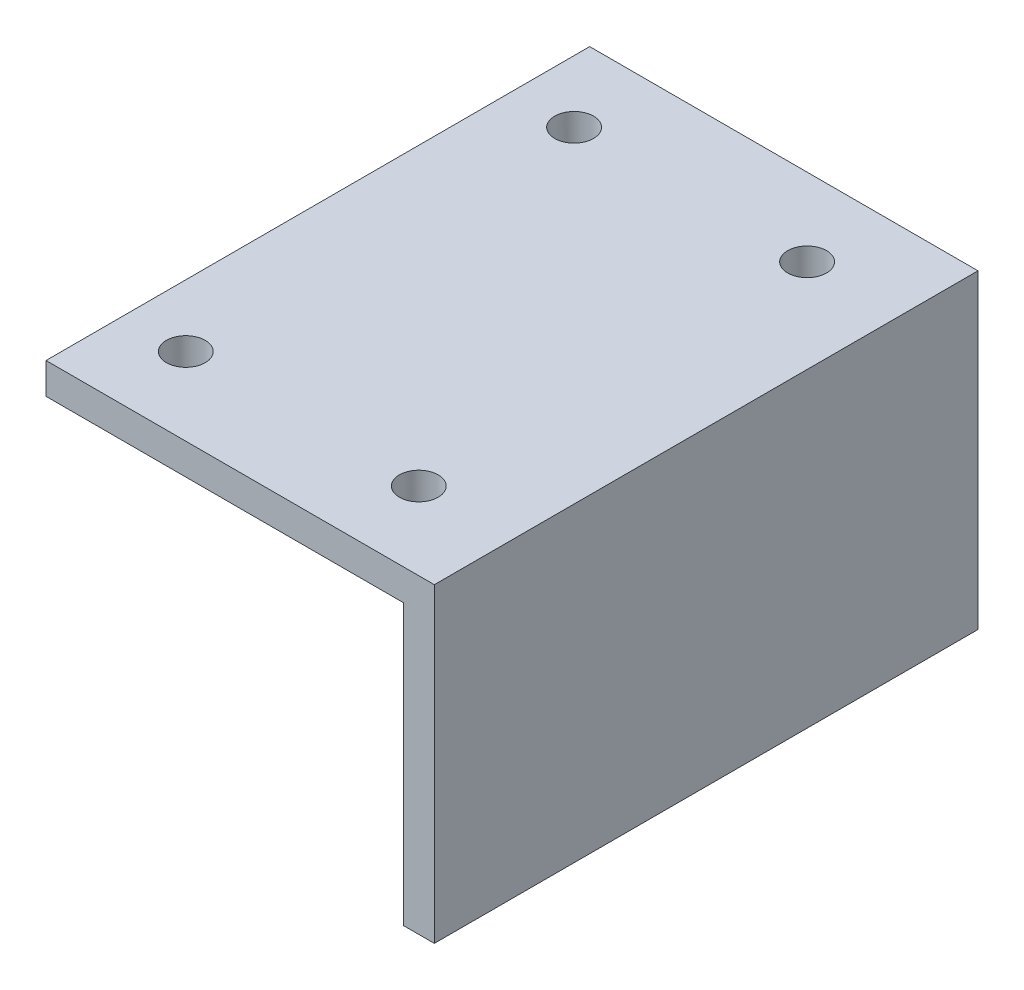
ISO-10303-21;
HEADER;
FILE_DESCRIPTION(('STEP AP214'),'2;1');
FILE_NAME('part.step','',(''),(''),'','','');
FILE_SCHEMA(('AUTOMOTIVE_DESIGN { 1 0 10303 214 1 1 1 1 }'));
ENDSEC;
DATA;
#1=APPLICATION_CONTEXT('core data for automotive mechanical design processes');
#2=APPLICATION_PROTOCOL_DEFINITION('international standard','automotive_design',2000,#1);
#3=PRODUCT_CONTEXT('',#1,'mechanical');
#4=PRODUCT('Part','Part','',(#3));
#5=PRODUCT_RELATED_PRODUCT_CATEGORY('part','',(#4));
#6=PRODUCT_DEFINITION_FORMATION('','',#4);
#7=PRODUCT_DEFINITION_CONTEXT('part definition',#1,'design');
#8=PRODUCT_DEFINITION('design','',#6,#7);
#9=PRODUCT_DEFINITION_SHAPE('','',#8);
#10=(LENGTH_UNIT() NAMED_UNIT(*) SI_UNIT(.MILLI.,.METRE.));
#11=(NAMED_UNIT(*) PLANE_ANGLE_UNIT() SI_UNIT($,.RADIAN.));
#12=(NAMED_UNIT(*) SI_UNIT($,.STERADIAN.) SOLID_ANGLE_UNIT());
#13=UNCERTAINTY_MEASURE_WITH_UNIT(LENGTH_MEASURE(1.E-05),#10,'distance_accuracy_value','');
#14=(GEOMETRIC_REPRESENTATION_CONTEXT(3) GLOBAL_UNCERTAINTY_ASSIGNED_CONTEXT((#13)) GLOBAL_UNIT_ASSIGNED_CONTEXT((#10,
#11,#12)) REPRESENTATION_CONTEXT('',''));
#15=CARTESIAN_POINT('',(0.,0.,0.));
#16=DIRECTION('',(0.,0.,1.));
#17=DIRECTION('',(1.,0.,0.));
#18=AXIS2_PLACEMENT_3D('',#15,#16,#17);
#19=CARTESIAN_POINT('',(0.,6.66133814775094E-13,-35.0000000000002));
#20=DIRECTION('',(1.00000000000001,0.,0.));
#21=DIRECTION('',(0.,1.00000000000001,0.));
#22=AXIS2_PLACEMENT_3D('',#19,#20,#21);
#23=PLANE('',#22);
#24=DIRECTION('',(0.,0.,1.));
#25=VECTOR('',#24,1.);
#26=CARTESIAN_POINT('',(-2.77555756156289E-13,-40.,-35.0000000000001));
#27=LINE('',#26,#25);
#28=CARTESIAN_POINT('',(-2.77555756156289E-13,-40.,-35.));
#29=VERTEX_POINT('',#28);
#30=CARTESIAN_POINT('',(3.60822483003176E-13,-40.0000000000006,34.9999999999997));
#31=VERTEX_POINT('',#30);
#32=EDGE_CURVE('E49',#29,#31,#27,.T.);
#33=ORIENTED_EDGE('',*,*,#32,.F.);
#34=DIRECTION('',(0.,1.00000000000001,0.));
#35=VECTOR('',#34,1.);
#36=CARTESIAN_POINT('',(0.,6.66133814775094E-13,-35.0000000000002));
#37=LINE('',#36,#35);
#38=CARTESIAN_POINT('',(0.,6.66133814775094E-13,-35.0000000000002));
#39=VERTEX_POINT('',#38);
#40=EDGE_CURVE('E101',#29,#39,#37,.T.);
#41=ORIENTED_EDGE('',*,*,#40,.T.);
#42=DIRECTION('',(0.,0.,1.));
#43=VECTOR('',#42,1.);
#44=CARTESIAN_POINT('',(0.,6.66133814775094E-13,-35.0000000000002));
#45=LINE('',#44,#43);
#46=CARTESIAN_POINT('',(0.,-1.33226762955019E-12,35.));
#47=VERTEX_POINT('',#46);
#48=EDGE_CURVE('E118',#39,#47,#45,.T.);
#49=ORIENTED_EDGE('',*,*,#48,.T.);
#50=DIRECTION('',(0.,1.00000000000001,0.));
#51=VECTOR('',#50,1.);
#52=CARTESIAN_POINT('',(0.,-1.33226762955019E-12,35.));
#53=LINE('',#52,#51);
#54=EDGE_CURVE('E127',#31,#47,#53,.T.);
#55=ORIENTED_EDGE('',*,*,#54,.F.);
#56=EDGE_LOOP('',(#33,#41,#49,#55));
#57=FACE_BOUND('',#56,.T.);
#58=ADVANCED_FACE('F36',(#57),#23,.T.);
#59=CARTESIAN_POINT('',(-3.99999999999998,-3.99999999999934,-35.0000000000001));
#60=DIRECTION('',(-1.00000000000001,0.,0.));
#61=DIRECTION('',(0.,0.,1.));
#62=AXIS2_PLACEMENT_3D('',#59,#60,#61);
#63=PLANE('',#62);
#64=DIRECTION('',(0.,0.,-1.));
#65=VECTOR('',#64,1.);
#66=CARTESIAN_POINT('',(-3.9999999999997,-40.0000000000006,34.9999999999993));
#67=LINE('',#66,#65);
#68=CARTESIAN_POINT('',(-3.9999999999997,-40.0000000000006,34.9999999999993));
#69=VERTEX_POINT('',#68);
#70=CARTESIAN_POINT('',(-4.00000000000028,-40.,-35.0000000000005));
#71=VERTEX_POINT('',#70);
#72=EDGE_CURVE('E86',#69,#71,#67,.T.);
#73=ORIENTED_EDGE('',*,*,#72,.F.);
#74=DIRECTION('',(0.,-1.00000000000001,0.));
#75=VECTOR('',#74,1.);
#76=CARTESIAN_POINT('',(-3.99999999999964,-4.00000000000134,35.));
#77=LINE('',#76,#75);
#78=CARTESIAN_POINT('',(-3.99999999999964,-4.00000000000134,35.));
#79=VERTEX_POINT('',#78);
#80=EDGE_CURVE('E92',#79,#69,#77,.T.);
#81=ORIENTED_EDGE('',*,*,#80,.F.);
#82=DIRECTION('',(0.,0.,1.));
#83=VECTOR('',#82,1.);
#84=CARTESIAN_POINT('',(-3.99999999999998,-3.99999999999934,-35.0000000000001));
#85=LINE('',#84,#83);
#86=CARTESIAN_POINT('',(-3.99999999999998,-3.99999999999934,-35.0000000000001));
#87=VERTEX_POINT('',#86);
#88=EDGE_CURVE('E43',#87,#79,#85,.T.);
#89=ORIENTED_EDGE('',*,*,#88,.F.);
#90=DIRECTION('',(0.,-1.00000000000001,0.));
#91=VECTOR('',#90,1.);
#92=CARTESIAN_POINT('',(-3.99999999999998,-3.99999999999934,-35.0000000000001));
#93=LINE('',#92,#91);
#94=EDGE_CURVE('E93',#87,#71,#93,.T.);
#95=ORIENTED_EDGE('',*,*,#94,.T.);
#96=EDGE_LOOP('',(#73,#81,#89,#95));
#97=FACE_BOUND('',#96,.T.);
#98=ADVANCED_FACE('F91',(#97),#63,.T.);
#99=CARTESIAN_POINT('',(-3.99999999999998,-3.99999999999934,-35.0000000000001));
#100=DIRECTION('',(0.,-1.00000000000001,0.));
#101=DIRECTION('',(0.,0.,-1.));
#102=AXIS2_PLACEMENT_3D('',#99,#100,#101);
#103=PLANE('',#102);
#104=CARTESIAN_POINT('',(-41.9999999999998,-3.99999999999934,-25.));
#105=DIRECTION('',(0.,-1.00000000000001,0.));
#106=DIRECTION('',(0.,0.,-1.));
#107=AXIS2_PLACEMENT_3D('',#104,#105,#106);
#108=CIRCLE('',#107,2.5);
#109=CARTESIAN_POINT('',(-41.9999999999998,-3.99999999999934,-27.5));
#110=VERTEX_POINT('',#109);
#111=EDGE_CURVE('E149',#110,#110,#108,.T.);
#112=ORIENTED_EDGE('',*,*,#111,.F.);
#113=EDGE_LOOP('',(#112));
#114=FACE_BOUND('',#113,.T.);
#115=CARTESIAN_POINT('',(-42.0000000000002,-4.,25.0000000000001));
#116=DIRECTION('',(0.,-1.00000000000001,0.));
#117=DIRECTION('',(0.,0.,-1.));
#118=AXIS2_PLACEMENT_3D('',#115,#116,#117);
#119=CIRCLE('',#118,2.5);
#120=CARTESIAN_POINT('',(-42.0000000000002,-4.,22.5000000000001));
#121=VERTEX_POINT('',#120);
#122=EDGE_CURVE('E148',#121,#121,#119,.T.);
#123=ORIENTED_EDGE('',*,*,#122,.F.);
#124=EDGE_LOOP('',(#123));
#125=FACE_BOUND('',#124,.T.);
#126=CARTESIAN_POINT('',(-12.0000000000001,-4.,25.));
#127=DIRECTION('',(0.,-1.00000000000001,0.));
#128=DIRECTION('',(0.,0.,-1.));
#129=AXIS2_PLACEMENT_3D('',#126,#127,#128);
#130=CIRCLE('',#129,2.5);
#131=CARTESIAN_POINT('',(-12.0000000000001,-4.,22.5));
#132=VERTEX_POINT('',#131);
#133=EDGE_CURVE('E155',#132,#132,#130,.T.);
#134=ORIENTED_EDGE('',*,*,#133,.F.);
#135=EDGE_LOOP('',(#134));
#136=FACE_BOUND('',#135,.T.);
#137=CARTESIAN_POINT('',(-12.,-3.99999999999934,-25.));
#138=DIRECTION('',(0.,-1.00000000000001,0.));
#139=DIRECTION('',(0.,0.,-1.));
#140=AXIS2_PLACEMENT_3D('',#137,#138,#139);
#141=CIRCLE('',#140,2.5);
#142=CARTESIAN_POINT('',(-12.,-3.99999999999934,-27.5));
#143=VERTEX_POINT('',#142);
#144=EDGE_CURVE('E141',#143,#143,#141,.T.);
#145=ORIENTED_EDGE('',*,*,#144,.F.);
#146=EDGE_LOOP('',(#145));
#147=FACE_BOUND('',#146,.T.);
#148=ORIENTED_EDGE('',*,*,#88,.T.);
#149=DIRECTION('',(1.00000000000001,0.,0.));
#150=VECTOR('',#149,1.);
#151=CARTESIAN_POINT('',(-3.99999999999964,-4.00000000000134,35.));
#152=LINE('',#151,#150);
#153=CARTESIAN_POINT('',(-50.,-4.00000000000067,35.0000000000001));
#154=VERTEX_POINT('',#153);
#155=EDGE_CURVE('E100',#154,#79,#152,.T.);
#156=ORIENTED_EDGE('',*,*,#155,.F.);
#157=DIRECTION('',(0.,0.,1.));
#158=VECTOR('',#157,1.);
#159=CARTESIAN_POINT('',(-50.0000000000008,-3.99999999999934,-35.0000000000004));
#160=LINE('',#159,#158);
#161=CARTESIAN_POINT('',(-50.0000000000008,-3.99999999999934,-35.0000000000004));
#162=VERTEX_POINT('',#161);
#163=EDGE_CURVE('E120',#162,#154,#160,.T.);
#164=ORIENTED_EDGE('',*,*,#163,.F.);
#165=DIRECTION('',(1.00000000000001,0.,0.));
#166=VECTOR('',#165,1.);
#167=CARTESIAN_POINT('',(-3.99999999999998,-3.99999999999934,-35.0000000000001));
#168=LINE('',#167,#166);
#169=EDGE_CURVE('E114',#162,#87,#168,.T.);
#170=ORIENTED_EDGE('',*,*,#169,.T.);
#171=EDGE_LOOP('',(#148,#156,#164,#170));
#172=FACE_BOUND('',#171,.T.);
#173=ADVANCED_FACE('F170',(#114,#125,#136,#147,#172),#103,.T.);
#174=CARTESIAN_POINT('',(-50.0000000000008,6.66133814775094E-13,-35.0000000000009));
#175=DIRECTION('',(-1.00000000000001,0.,0.));
#176=DIRECTION('',(0.,0.,1.));
#177=AXIS2_PLACEMENT_3D('',#174,#175,#176);
#178=PLANE('',#177);
#179=ORIENTED_EDGE('',*,*,#163,.T.);
#180=DIRECTION('',(0.,-1.00000000000001,0.));
#181=VECTOR('',#180,1.);
#182=CARTESIAN_POINT('',(-50.0000000000005,-6.66133814775094E-13,35.0000000000002));
#183=LINE('',#182,#181);
#184=CARTESIAN_POINT('',(-50.0000000000005,-6.66133814775094E-13,35.0000000000002));
#185=VERTEX_POINT('',#184);
#186=EDGE_CURVE('E105',#185,#154,#183,.T.);
#187=ORIENTED_EDGE('',*,*,#186,.F.);
#188=DIRECTION('',(0.,0.,1.));
#189=VECTOR('',#188,1.);
#190=CARTESIAN_POINT('',(-50.0000000000008,6.66133814775094E-13,-35.0000000000009));
#191=LINE('',#190,#189);
#192=CARTESIAN_POINT('',(-50.0000000000008,6.66133814775094E-13,-35.0000000000009));
#193=VERTEX_POINT('',#192);
#194=EDGE_CURVE('E122',#193,#185,#191,.T.);
#195=ORIENTED_EDGE('',*,*,#194,.F.);
#196=DIRECTION('',(0.,-1.00000000000001,0.));
#197=VECTOR('',#196,1.);
#198=CARTESIAN_POINT('',(-50.0000000000008,6.66133814775094E-13,-35.0000000000009));
#199=LINE('',#198,#197);
#200=EDGE_CURVE('E111',#193,#162,#199,.T.);
#201=ORIENTED_EDGE('',*,*,#200,.T.);
#202=EDGE_LOOP('',(#179,#187,#195,#201));
#203=FACE_BOUND('',#202,.T.);
#204=ADVANCED_FACE('F168',(#203),#178,.T.);
#205=CARTESIAN_POINT('',(0.,6.66133814775094E-13,-35.0000000000002));
#206=DIRECTION('',(0.,1.00000000000001,0.));
#207=DIRECTION('',(0.,0.,1.));
#208=AXIS2_PLACEMENT_3D('',#205,#206,#207);
#209=PLANE('',#208);
#210=CARTESIAN_POINT('',(-41.9999999999998,6.66133814775094E-13,-25.));
#211=DIRECTION('',(0.,1.00000000000001,0.));
#212=DIRECTION('',(0.,0.,1.));
#213=AXIS2_PLACEMENT_3D('',#210,#211,#212);
#214=CIRCLE('',#213,2.5);
#215=CARTESIAN_POINT('',(-41.9999999999998,6.66133814766069E-13,-22.5));
#216=VERTEX_POINT('',#215);
#217=EDGE_CURVE('E145',#216,#216,#214,.F.);
#218=ORIENTED_EDGE('',*,*,#217,.T.);
#219=EDGE_LOOP('',(#218));
#220=FACE_BOUND('',#219,.T.);
#221=CARTESIAN_POINT('',(-42.0000000000002,0.,25.0000000000002));
#222=DIRECTION('',(0.,1.00000000000001,0.));
#223=DIRECTION('',(0.,0.,1.));
#224=AXIS2_PLACEMENT_3D('',#221,#222,#223);
#225=CIRCLE('',#224,2.5);
#226=CARTESIAN_POINT('',(-42.0000000000002,0.,27.5000000000002));
#227=VERTEX_POINT('',#226);
#228=EDGE_CURVE('E152',#227,#227,#225,.F.);
#229=ORIENTED_EDGE('',*,*,#228,.T.);
#230=EDGE_LOOP('',(#229));
#231=FACE_BOUND('',#230,.T.);
#232=CARTESIAN_POINT('',(-12.0000000000001,0.,25.));
#233=DIRECTION('',(0.,1.00000000000001,0.));
#234=DIRECTION('',(0.,0.,1.));
#235=AXIS2_PLACEMENT_3D('',#232,#233,#234);
#236=CIRCLE('',#235,2.5);
#237=CARTESIAN_POINT('',(-12.0000000000001,0.,27.5));
#238=VERTEX_POINT('',#237);
#239=EDGE_CURVE('E144',#238,#238,#236,.F.);
#240=ORIENTED_EDGE('',*,*,#239,.T.);
#241=EDGE_LOOP('',(#240));
#242=FACE_BOUND('',#241,.T.);
#243=CARTESIAN_POINT('',(-12.,6.66133814775094E-13,-25.));
#244=DIRECTION('',(0.,1.00000000000001,0.));
#245=DIRECTION('',(0.,0.,1.));
#246=AXIS2_PLACEMENT_3D('',#243,#244,#245);
#247=CIRCLE('',#246,2.5);
#248=CARTESIAN_POINT('',(-12.,6.66133814766069E-13,-22.5));
#249=VERTEX_POINT('',#248);
#250=EDGE_CURVE('E136',#249,#249,#247,.F.);
#251=ORIENTED_EDGE('',*,*,#250,.T.);
#252=EDGE_LOOP('',(#251));
#253=FACE_BOUND('',#252,.T.);
#254=ORIENTED_EDGE('',*,*,#194,.T.);
#255=DIRECTION('',(-1.00000000000001,0.,0.));
#256=VECTOR('',#255,1.);
#257=CARTESIAN_POINT('',(0.,-1.33226762955019E-12,35.));
#258=LINE('',#257,#256);
#259=EDGE_CURVE('E132',#47,#185,#258,.T.);
#260=ORIENTED_EDGE('',*,*,#259,.F.);
#261=ORIENTED_EDGE('',*,*,#48,.F.);
#262=DIRECTION('',(-1.00000000000001,0.,0.));
#263=VECTOR('',#262,1.);
#264=CARTESIAN_POINT('',(0.,6.66133814775094E-13,-35.0000000000002));
#265=LINE('',#264,#263);
#266=EDGE_CURVE('E103',#39,#193,#265,.T.);
#267=ORIENTED_EDGE('',*,*,#266,.T.);
#268=EDGE_LOOP('',(#254,#260,#261,#267));
#269=FACE_BOUND('',#268,.T.);
#270=ADVANCED_FACE('F133',(#220,#231,#242,#253,#269),#209,.T.);
#271=CARTESIAN_POINT('',(0.,6.66133814775094E-13,-35.0000000000002));
#272=DIRECTION('',(0.,0.,1.));
#273=DIRECTION('',(1.00000000000001,0.,0.));
#274=AXIS2_PLACEMENT_3D('',#271,#272,#273);
#275=PLANE('',#274);
#276=ORIENTED_EDGE('',*,*,#40,.F.);
#277=DIRECTION('',(-1.00000000000001,0.,0.));
#278=VECTOR('',#277,1.);
#279=CARTESIAN_POINT('',(5.99999999999973,-40.,-35.));
#280=LINE('',#279,#278);
#281=EDGE_CURVE('E94',#29,#71,#280,.T.);
#282=ORIENTED_EDGE('',*,*,#281,.T.);
#283=ORIENTED_EDGE('',*,*,#94,.F.);
#284=ORIENTED_EDGE('',*,*,#169,.F.);
#285=ORIENTED_EDGE('',*,*,#200,.F.);
#286=ORIENTED_EDGE('',*,*,#266,.F.);
#287=EDGE_LOOP('',(#276,#282,#283,#284,#285,#286));
#288=FACE_BOUND('',#287,.T.);
#289=ADVANCED_FACE('F164',(#288),#275,.F.);
#290=CARTESIAN_POINT('',(0.,-1.33226762955019E-12,35.));
#291=DIRECTION('',(0.,0.,1.));
#292=DIRECTION('',(1.00000000000001,0.,0.));
#293=AXIS2_PLACEMENT_3D('',#290,#291,#292);
#294=PLANE('',#293);
#295=DIRECTION('',(-1.00000000000001,0.,0.));
#296=VECTOR('',#295,1.);
#297=CARTESIAN_POINT('',(3.60822483003176E-13,-40.0000000000006,34.9999999999997));
#298=LINE('',#297,#296);
#299=EDGE_CURVE('E11',#31,#69,#298,.T.);
#300=ORIENTED_EDGE('',*,*,#299,.F.);
#301=ORIENTED_EDGE('',*,*,#54,.T.);
#302=ORIENTED_EDGE('',*,*,#259,.T.);
#303=ORIENTED_EDGE('',*,*,#186,.T.);
#304=ORIENTED_EDGE('',*,*,#155,.T.);
#305=ORIENTED_EDGE('',*,*,#80,.T.);
#306=EDGE_LOOP('',(#300,#301,#302,#303,#304,#305));
#307=FACE_BOUND('',#306,.T.);
#308=ADVANCED_FACE('F97',(#307),#294,.T.);
#309=CARTESIAN_POINT('',(-12.0000000000003,7.07106781186612,-25.));
#310=DIRECTION('',(0.,-1.00000000000001,0.));
#311=DIRECTION('',(0.,0.,-1.));
#312=AXIS2_PLACEMENT_3D('',#309,#310,#311);
#313=CYLINDRICAL_SURFACE('',#312,2.5);
#314=ORIENTED_EDGE('',*,*,#144,.T.);
#315=EDGE_LOOP('',(#314));
#316=FACE_BOUND('',#315,.T.);
#317=ORIENTED_EDGE('',*,*,#250,.F.);
#318=EDGE_LOOP('',(#317));
#319=FACE_BOUND('',#318,.T.);
#320=ADVANCED_FACE('F224',(#316,#319),#313,.F.);
#321=CARTESIAN_POINT('',(-12.0000000000001,7.07106781186551,24.9999999999997));
#322=DIRECTION('',(0.,-1.00000000000001,0.));
#323=DIRECTION('',(0.,0.,-1.));
#324=AXIS2_PLACEMENT_3D('',#321,#322,#323);
#325=CYLINDRICAL_SURFACE('',#324,2.5);
#326=ORIENTED_EDGE('',*,*,#133,.T.);
#327=EDGE_LOOP('',(#326));
#328=FACE_BOUND('',#327,.T.);
#329=ORIENTED_EDGE('',*,*,#239,.F.);
#330=EDGE_LOOP('',(#329));
#331=FACE_BOUND('',#330,.T.);
#332=ADVANCED_FACE('F233',(#328,#331),#325,.F.);
#333=CARTESIAN_POINT('',(-42.0000000000002,7.07106781186551,24.9999999999997));
#334=DIRECTION('',(0.,-1.00000000000001,0.));
#335=DIRECTION('',(0.,0.,-1.));
#336=AXIS2_PLACEMENT_3D('',#333,#334,#335);
#337=CYLINDRICAL_SURFACE('',#336,2.5);
#338=ORIENTED_EDGE('',*,*,#122,.T.);
#339=EDGE_LOOP('',(#338));
#340=FACE_BOUND('',#339,.T.);
#341=ORIENTED_EDGE('',*,*,#228,.F.);
#342=EDGE_LOOP('',(#341));
#343=FACE_BOUND('',#342,.T.);
#344=ADVANCED_FACE('F243',(#340,#343),#337,.F.);
#345=CARTESIAN_POINT('',(-42.0000000000001,7.07106781186612,-24.9999999999999));
#346=DIRECTION('',(0.,-1.00000000000001,0.));
#347=DIRECTION('',(0.,0.,-1.));
#348=AXIS2_PLACEMENT_3D('',#345,#346,#347);
#349=CYLINDRICAL_SURFACE('',#348,2.5);
#350=ORIENTED_EDGE('',*,*,#111,.T.);
#351=EDGE_LOOP('',(#350));
#352=FACE_BOUND('',#351,.T.);
#353=ORIENTED_EDGE('',*,*,#217,.F.);
#354=EDGE_LOOP('',(#353));
#355=FACE_BOUND('',#354,.T.);
#356=ADVANCED_FACE('F253',(#352,#355),#349,.F.);
#357=CARTESIAN_POINT('',(6.00000000000031,-40.0000000000006,34.9999999999997));
#358=DIRECTION('',(0.,1.00000000000001,0.));
#359=DIRECTION('',(0.,0.,1.));
#360=AXIS2_PLACEMENT_3D('',#357,#358,#359);
#361=PLANE('',#360);
#362=ORIENTED_EDGE('',*,*,#32,.T.);
#363=ORIENTED_EDGE('',*,*,#299,.T.);
#364=ORIENTED_EDGE('',*,*,#72,.T.);
#365=ORIENTED_EDGE('',*,*,#281,.F.);
#366=EDGE_LOOP('',(#362,#363,#364,#365));
#367=FACE_BOUND('',#366,.T.);
#368=ADVANCED_FACE('F85',(#367),#361,.F.);
#369=CLOSED_SHELL('',(#58,#98,#173,#204,#270,#289,#308,#320,#332,#344,#356,#368));
#370=MANIFOLD_SOLID_BREP('B2',#369);
#371=ADVANCED_BREP_SHAPE_REPRESENTATION('',(#18,#370),#14);
#372=SHAPE_DEFINITION_REPRESENTATION(#9,#371);
ENDSEC;
END-ISO-10303-21;
